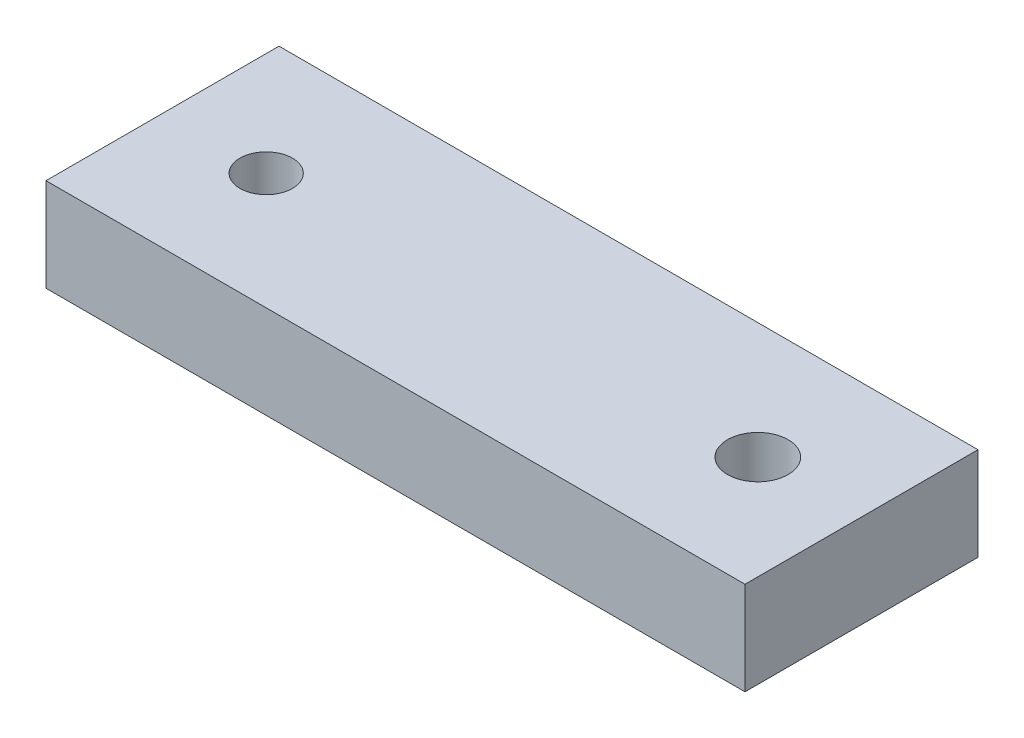
ISO-10303-21;
HEADER;
FILE_DESCRIPTION(('STEP AP214'),'2;1');
FILE_NAME('part.step','',(''),(''),'','','');
FILE_SCHEMA(('AUTOMOTIVE_DESIGN { 1 0 10303 214 1 1 1 1 }'));
ENDSEC;
DATA;
#1=APPLICATION_CONTEXT('core data for automotive mechanical design processes');
#2=APPLICATION_PROTOCOL_DEFINITION('international standard','automotive_design',2000,#1);
#3=PRODUCT_CONTEXT('',#1,'mechanical');
#4=PRODUCT('Part','Part','',(#3));
#5=PRODUCT_RELATED_PRODUCT_CATEGORY('part','',(#4));
#6=PRODUCT_DEFINITION_FORMATION('','',#4);
#7=PRODUCT_DEFINITION_CONTEXT('part definition',#1,'design');
#8=PRODUCT_DEFINITION('design','',#6,#7);
#9=PRODUCT_DEFINITION_SHAPE('','',#8);
#10=(LENGTH_UNIT() NAMED_UNIT(*) SI_UNIT(.MILLI.,.METRE.));
#11=(NAMED_UNIT(*) PLANE_ANGLE_UNIT() SI_UNIT($,.RADIAN.));
#12=(NAMED_UNIT(*) SI_UNIT($,.STERADIAN.) SOLID_ANGLE_UNIT());
#13=UNCERTAINTY_MEASURE_WITH_UNIT(LENGTH_MEASURE(1.E-05),#10,'distance_accuracy_value','');
#14=(GEOMETRIC_REPRESENTATION_CONTEXT(3) GLOBAL_UNCERTAINTY_ASSIGNED_CONTEXT((#13)) GLOBAL_UNIT_ASSIGNED_CONTEXT((#10,
#11,#12)) REPRESENTATION_CONTEXT('',''));
#15=CARTESIAN_POINT('',(0.,0.,0.));
#16=DIRECTION('',(0.,0.,1.));
#17=DIRECTION('',(1.,0.,0.));
#18=AXIS2_PLACEMENT_3D('',#15,#16,#17);
#19=CARTESIAN_POINT('',(-34.8294446067815,8.,-5.74801377834074));
#20=DIRECTION('',(1.,0.,0.));
#21=DIRECTION('',(0.,0.,-1.));
#22=AXIS2_PLACEMENT_3D('',#19,#20,#21);
#23=PLANE('',#22);
#24=DIRECTION('',(0.,0.,1.));
#25=VECTOR('',#24,1.);
#26=CARTESIAN_POINT('',(-34.8294446067815,0.,-5.74801377834074));
#27=LINE('',#26,#25);
#28=CARTESIAN_POINT('',(-34.8294446067815,0.,-5.74801377834074));
#29=VERTEX_POINT('',#28);
#30=CARTESIAN_POINT('',(-34.8294446067815,0.,14.2519862216593));
#31=VERTEX_POINT('',#30);
#32=EDGE_CURVE('E98',#29,#31,#27,.T.);
#33=ORIENTED_EDGE('',*,*,#32,.T.);
#34=DIRECTION('',(0.,-1.,0.));
#35=VECTOR('',#34,1.);
#36=CARTESIAN_POINT('',(-34.8294446067815,8.,14.2519862216593));
#37=LINE('',#36,#35);
#38=CARTESIAN_POINT('',(-34.8294446067815,8.,14.2519862216593));
#39=VERTEX_POINT('',#38);
#40=EDGE_CURVE('E11',#39,#31,#37,.T.);
#41=ORIENTED_EDGE('',*,*,#40,.F.);
#42=DIRECTION('',(0.,0.,1.));
#43=VECTOR('',#42,1.);
#44=CARTESIAN_POINT('',(-34.8294446067815,8.,-5.74801377834074));
#45=LINE('',#44,#43);
#46=CARTESIAN_POINT('',(-34.8294446067815,8.,-5.74801377834074));
#47=VERTEX_POINT('',#46);
#48=EDGE_CURVE('E86',#47,#39,#45,.T.);
#49=ORIENTED_EDGE('',*,*,#48,.F.);
#50=DIRECTION('',(0.,-1.,0.));
#51=VECTOR('',#50,1.);
#52=CARTESIAN_POINT('',(-34.8294446067815,8.,-5.74801377834074));
#53=LINE('',#52,#51);
#54=EDGE_CURVE('E94',#47,#29,#53,.T.);
#55=ORIENTED_EDGE('',*,*,#54,.T.);
#56=EDGE_LOOP('',(#33,#41,#49,#55));
#57=FACE_BOUND('',#56,.T.);
#58=ADVANCED_FACE('F35',(#57),#23,.F.);
#59=CARTESIAN_POINT('',(-34.8294446067815,8.,14.2519862216593));
#60=DIRECTION('',(0.,0.,-1.));
#61=DIRECTION('',(-1.,0.,0.));
#62=AXIS2_PLACEMENT_3D('',#59,#60,#61);
#63=PLANE('',#62);
#64=DIRECTION('',(1.,0.,0.));
#65=VECTOR('',#64,1.);
#66=CARTESIAN_POINT('',(-34.8294446067815,0.,14.2519862216593));
#67=LINE('',#66,#65);
#68=CARTESIAN_POINT('',(25.1705553932185,0.,14.2519862216593));
#69=VERTEX_POINT('',#68);
#70=EDGE_CURVE('E90',#31,#69,#67,.T.);
#71=ORIENTED_EDGE('',*,*,#70,.T.);
#72=DIRECTION('',(0.,-1.,0.));
#73=VECTOR('',#72,1.);
#74=CARTESIAN_POINT('',(25.1705553932185,8.,14.2519862216593));
#75=LINE('',#74,#73);
#76=CARTESIAN_POINT('',(25.1705553932185,8.,14.2519862216593));
#77=VERTEX_POINT('',#76);
#78=EDGE_CURVE('E43',#77,#69,#75,.T.);
#79=ORIENTED_EDGE('',*,*,#78,.F.);
#80=DIRECTION('',(1.,0.,0.));
#81=VECTOR('',#80,1.);
#82=CARTESIAN_POINT('',(-34.8294446067815,8.,14.2519862216593));
#83=LINE('',#82,#81);
#84=EDGE_CURVE('E81',#39,#77,#83,.T.);
#85=ORIENTED_EDGE('',*,*,#84,.F.);
#86=ORIENTED_EDGE('',*,*,#40,.T.);
#87=EDGE_LOOP('',(#71,#79,#85,#86));
#88=FACE_BOUND('',#87,.T.);
#89=ADVANCED_FACE('F89',(#88),#63,.F.);
#90=CARTESIAN_POINT('',(25.1705553932185,8.,-5.74801377834074));
#91=DIRECTION('',(-1.,0.,0.));
#92=DIRECTION('',(0.,0.,1.));
#93=AXIS2_PLACEMENT_3D('',#90,#91,#92);
#94=PLANE('',#93);
#95=DIRECTION('',(0.,0.,-1.));
#96=VECTOR('',#95,1.);
#97=CARTESIAN_POINT('',(25.1705553932185,0.,-5.74801377834074));
#98=LINE('',#97,#96);
#99=CARTESIAN_POINT('',(25.1705553932185,0.,-5.74801377834074));
#100=VERTEX_POINT('',#99);
#101=EDGE_CURVE('E68',#69,#100,#98,.T.);
#102=ORIENTED_EDGE('',*,*,#101,.T.);
#103=DIRECTION('',(0.,-1.,0.));
#104=VECTOR('',#103,1.);
#105=CARTESIAN_POINT('',(25.1705553932185,8.,-5.74801377834074));
#106=LINE('',#105,#104);
#107=CARTESIAN_POINT('',(25.1705553932185,8.,-5.74801377834074));
#108=VERTEX_POINT('',#107);
#109=EDGE_CURVE('E91',#108,#100,#106,.T.);
#110=ORIENTED_EDGE('',*,*,#109,.F.);
#111=DIRECTION('',(0.,0.,-1.));
#112=VECTOR('',#111,1.);
#113=CARTESIAN_POINT('',(25.1705553932185,8.,-5.74801377834074));
#114=LINE('',#113,#112);
#115=EDGE_CURVE('E84',#77,#108,#114,.T.);
#116=ORIENTED_EDGE('',*,*,#115,.F.);
#117=ORIENTED_EDGE('',*,*,#78,.T.);
#118=EDGE_LOOP('',(#102,#110,#116,#117));
#119=FACE_BOUND('',#118,.T.);
#120=ADVANCED_FACE('F92',(#119),#94,.F.);
#121=CARTESIAN_POINT('',(-34.8294446067815,8.,-5.74801377834074));
#122=DIRECTION('',(0.,0.,1.));
#123=DIRECTION('',(1.,0.,0.));
#124=AXIS2_PLACEMENT_3D('',#121,#122,#123);
#125=PLANE('',#124);
#126=DIRECTION('',(-1.,0.,0.));
#127=VECTOR('',#126,1.);
#128=CARTESIAN_POINT('',(-34.8294446067815,0.,-5.74801377834074));
#129=LINE('',#128,#127);
#130=EDGE_CURVE('E74',#100,#29,#129,.T.);
#131=ORIENTED_EDGE('',*,*,#130,.T.);
#132=ORIENTED_EDGE('',*,*,#54,.F.);
#133=DIRECTION('',(-1.,0.,0.));
#134=VECTOR('',#133,1.);
#135=CARTESIAN_POINT('',(-34.8294446067815,8.,-5.74801377834074));
#136=LINE('',#135,#134);
#137=EDGE_CURVE('E51',#108,#47,#136,.T.);
#138=ORIENTED_EDGE('',*,*,#137,.F.);
#139=ORIENTED_EDGE('',*,*,#109,.T.);
#140=EDGE_LOOP('',(#131,#132,#138,#139));
#141=FACE_BOUND('',#140,.T.);
#142=ADVANCED_FACE('F106',(#141),#125,.F.);
#143=CARTESIAN_POINT('',(0.,8.,0.));
#144=DIRECTION('',(0.,1.,0.));
#145=DIRECTION('',(0.,0.,1.));
#146=AXIS2_PLACEMENT_3D('',#143,#144,#145);
#147=PLANE('',#146);
#148=CARTESIAN_POINT('',(-25.9294446067815,8.,4.25198622165926));
#149=DIRECTION('',(0.,1.,0.));
#150=DIRECTION('',(0.,0.,1.));
#151=AXIS2_PLACEMENT_3D('',#148,#149,#150);
#152=CIRCLE('',#151,2.2544821821006);
#153=CARTESIAN_POINT('',(-25.9294446067815,8.,6.50646840375986));
#154=VERTEX_POINT('',#153);
#155=EDGE_CURVE('E118',#154,#154,#152,.T.);
#156=ORIENTED_EDGE('',*,*,#155,.F.);
#157=EDGE_LOOP('',(#156));
#158=FACE_BOUND('',#157,.T.);
#159=CARTESIAN_POINT('',(16.2705553932185,8.,4.25198622165926));
#160=DIRECTION('',(0.,1.,0.));
#161=DIRECTION('',(0.,0.,1.));
#162=AXIS2_PLACEMENT_3D('',#159,#160,#161);
#163=CIRCLE('',#162,2.6);
#164=CARTESIAN_POINT('',(16.2705553932185,8.,6.85198622165926));
#165=VERTEX_POINT('',#164);
#166=EDGE_CURVE('E112',#165,#165,#163,.T.);
#167=ORIENTED_EDGE('',*,*,#166,.F.);
#168=EDGE_LOOP('',(#167));
#169=FACE_BOUND('',#168,.T.);
#170=ORIENTED_EDGE('',*,*,#48,.T.);
#171=ORIENTED_EDGE('',*,*,#84,.T.);
#172=ORIENTED_EDGE('',*,*,#115,.T.);
#173=ORIENTED_EDGE('',*,*,#137,.T.);
#174=EDGE_LOOP('',(#170,#171,#172,#173));
#175=FACE_BOUND('',#174,.T.);
#176=ADVANCED_FACE('F82',(#158,#169,#175),#147,.T.);
#177=CARTESIAN_POINT('',(0.,0.,0.));
#178=DIRECTION('',(0.,1.,0.));
#179=DIRECTION('',(0.,0.,1.));
#180=AXIS2_PLACEMENT_3D('',#177,#178,#179);
#181=PLANE('',#180);
#182=CARTESIAN_POINT('',(-25.9294446067815,0.,4.25198622165926));
#183=DIRECTION('',(0.,1.,0.));
#184=DIRECTION('',(0.,0.,1.));
#185=AXIS2_PLACEMENT_3D('',#182,#183,#184);
#186=CIRCLE('',#185,2.2544821821006);
#187=CARTESIAN_POINT('',(-25.9294446067815,0.,6.50646840375986));
#188=VERTEX_POINT('',#187);
#189=EDGE_CURVE('E101',#188,#188,#186,.T.);
#190=ORIENTED_EDGE('',*,*,#189,.T.);
#191=EDGE_LOOP('',(#190));
#192=FACE_BOUND('',#191,.T.);
#193=CARTESIAN_POINT('',(16.2705553932185,0.,4.25198622165926));
#194=DIRECTION('',(0.,1.,0.));
#195=DIRECTION('',(0.,0.,1.));
#196=AXIS2_PLACEMENT_3D('',#193,#194,#195);
#197=CIRCLE('',#196,2.6);
#198=CARTESIAN_POINT('',(16.2705553932185,0.,6.85198622165926));
#199=VERTEX_POINT('',#198);
#200=EDGE_CURVE('E115',#199,#199,#197,.T.);
#201=ORIENTED_EDGE('',*,*,#200,.T.);
#202=EDGE_LOOP('',(#201));
#203=FACE_BOUND('',#202,.T.);
#204=ORIENTED_EDGE('',*,*,#32,.F.);
#205=ORIENTED_EDGE('',*,*,#130,.F.);
#206=ORIENTED_EDGE('',*,*,#101,.F.);
#207=ORIENTED_EDGE('',*,*,#70,.F.);
#208=EDGE_LOOP('',(#204,#205,#206,#207));
#209=FACE_BOUND('',#208,.T.);
#210=ADVANCED_FACE('F109',(#192,#203,#209),#181,.F.);
#211=CARTESIAN_POINT('',(16.2705553932185,0.,4.25198622165926));
#212=DIRECTION('',(0.,1.,0.));
#213=DIRECTION('',(0.,0.,1.));
#214=AXIS2_PLACEMENT_3D('',#211,#212,#213);
#215=CYLINDRICAL_SURFACE('',#214,2.6);
#216=ORIENTED_EDGE('',*,*,#200,.F.);
#217=EDGE_LOOP('',(#216));
#218=FACE_BOUND('',#217,.T.);
#219=ORIENTED_EDGE('',*,*,#166,.T.);
#220=EDGE_LOOP('',(#219));
#221=FACE_BOUND('',#220,.T.);
#222=ADVANCED_FACE('F129',(#218,#221),#215,.F.);
#223=CARTESIAN_POINT('',(-25.9294446067815,0.,4.25198622165926));
#224=DIRECTION('',(0.,1.,0.));
#225=DIRECTION('',(0.,0.,1.));
#226=AXIS2_PLACEMENT_3D('',#223,#224,#225);
#227=CYLINDRICAL_SURFACE('',#226,2.2544821821006);
#228=ORIENTED_EDGE('',*,*,#189,.F.);
#229=EDGE_LOOP('',(#228));
#230=FACE_BOUND('',#229,.T.);
#231=ORIENTED_EDGE('',*,*,#155,.T.);
#232=EDGE_LOOP('',(#231));
#233=FACE_BOUND('',#232,.T.);
#234=ADVANCED_FACE('F126',(#230,#233),#227,.F.);
#235=CLOSED_SHELL('',(#58,#89,#120,#142,#176,#210,#222,#234));
#236=MANIFOLD_SOLID_BREP('B2',#235);
#237=ADVANCED_BREP_SHAPE_REPRESENTATION('',(#18,#236),#14);
#238=SHAPE_DEFINITION_REPRESENTATION(#9,#237);
ENDSEC;
END-ISO-10303-21;
